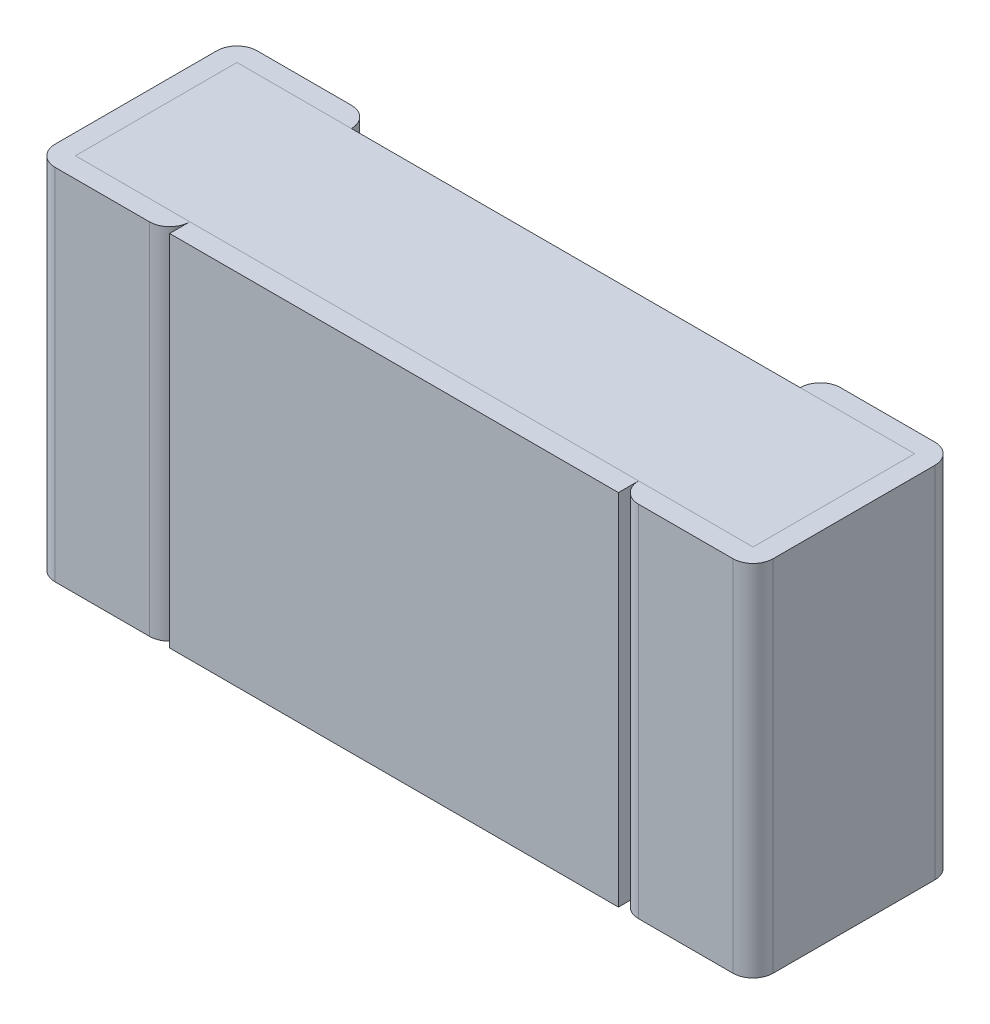
ISO-10303-21;
HEADER;
FILE_DESCRIPTION(('STEP AP214'),'2;1');
FILE_NAME('part.step','',(''),(''),'','','');
FILE_SCHEMA(('AUTOMOTIVE_DESIGN { 1 0 10303 214 1 1 1 1 }'));
ENDSEC;
DATA;
#1=APPLICATION_CONTEXT('core data for automotive mechanical design processes');
#2=APPLICATION_PROTOCOL_DEFINITION('international standard','automotive_design',2000,#1);
#3=PRODUCT_CONTEXT('',#1,'mechanical');
#4=PRODUCT('Part','Part','',(#3));
#5=PRODUCT_RELATED_PRODUCT_CATEGORY('part','',(#4));
#6=PRODUCT_DEFINITION_FORMATION('','',#4);
#7=PRODUCT_DEFINITION_CONTEXT('part definition',#1,'design');
#8=PRODUCT_DEFINITION('design','',#6,#7);
#9=PRODUCT_DEFINITION_SHAPE('','',#8);
#10=(LENGTH_UNIT() NAMED_UNIT(*) SI_UNIT(.MILLI.,.METRE.));
#11=(NAMED_UNIT(*) PLANE_ANGLE_UNIT() SI_UNIT($,.RADIAN.));
#12=(NAMED_UNIT(*) SI_UNIT($,.STERADIAN.) SOLID_ANGLE_UNIT());
#13=UNCERTAINTY_MEASURE_WITH_UNIT(LENGTH_MEASURE(1.E-05),#10,'distance_accuracy_value','');
#14=(GEOMETRIC_REPRESENTATION_CONTEXT(3) GLOBAL_UNCERTAINTY_ASSIGNED_CONTEXT((#13)) GLOBAL_UNIT_ASSIGNED_CONTEXT((#10,
#11,#12)) REPRESENTATION_CONTEXT('',''));
#15=CARTESIAN_POINT('',(0.,0.,0.));
#16=DIRECTION('',(0.,0.,1.));
#17=DIRECTION('',(1.,0.,0.));
#18=AXIS2_PLACEMENT_3D('',#15,#16,#17);
#19=CARTESIAN_POINT('',(-0.5,-0.4,0.45));
#20=DIRECTION('',(0.,0.,1.));
#21=DIRECTION('',(1.,0.,0.));
#22=AXIS2_PLACEMENT_3D('',#19,#20,#21);
#23=PLANE('',#22);
#24=DIRECTION('',(0.,1.,0.));
#25=VECTOR('',#24,1.);
#26=CARTESIAN_POINT('',(-0.5,-0.4,0.45));
#27=LINE('',#26,#25);
#28=CARTESIAN_POINT('',(-0.5,-0.4,0.45));
#29=VERTEX_POINT('',#28);
#30=CARTESIAN_POINT('',(-0.5,0.4,0.45));
#31=VERTEX_POINT('',#30);
#32=EDGE_CURVE('E295',#29,#31,#27,.T.);
#33=ORIENTED_EDGE('',*,*,#32,.F.);
#34=DIRECTION('',(1.,0.,0.));
#35=VECTOR('',#34,1.);
#36=CARTESIAN_POINT('',(-0.5,-0.4,0.45));
#37=LINE('',#36,#35);
#38=CARTESIAN_POINT('',(0.5,-0.4,0.45));
#39=VERTEX_POINT('',#38);
#40=EDGE_CURVE('E238',#29,#39,#37,.T.);
#41=ORIENTED_EDGE('',*,*,#40,.T.);
#42=DIRECTION('',(0.,1.,0.));
#43=VECTOR('',#42,1.);
#44=CARTESIAN_POINT('',(0.5,-0.4,0.45));
#45=LINE('',#44,#43);
#46=CARTESIAN_POINT('',(0.5,0.4,0.45));
#47=VERTEX_POINT('',#46);
#48=EDGE_CURVE('E11',#39,#47,#45,.T.);
#49=ORIENTED_EDGE('',*,*,#48,.T.);
#50=DIRECTION('',(1.,0.,0.));
#51=VECTOR('',#50,1.);
#52=CARTESIAN_POINT('',(-0.5,0.4,0.45));
#53=LINE('',#52,#51);
#54=EDGE_CURVE('E203',#31,#47,#53,.T.);
#55=ORIENTED_EDGE('',*,*,#54,.F.);
#56=EDGE_LOOP('',(#33,#41,#49,#55));
#57=FACE_BOUND('',#56,.T.);
#58=ADVANCED_FACE('F17',(#57),#23,.T.);
#59=CARTESIAN_POINT('',(0.5,-0.4,0.405));
#60=DIRECTION('',(1.,0.,0.));
#61=DIRECTION('',(0.,1.,0.));
#62=AXIS2_PLACEMENT_3D('',#59,#60,#61);
#63=PLANE('',#62);
#64=DIRECTION('',(0.,0.,1.));
#65=VECTOR('',#64,1.);
#66=CARTESIAN_POINT('',(0.5,-0.4,0.405));
#67=LINE('',#66,#65);
#68=CARTESIAN_POINT('',(0.5,-0.4,0.405));
#69=VERTEX_POINT('',#68);
#70=EDGE_CURVE('E227',#69,#39,#67,.T.);
#71=ORIENTED_EDGE('',*,*,#70,.F.);
#72=DIRECTION('',(0.,1.,0.));
#73=VECTOR('',#72,1.);
#74=CARTESIAN_POINT('',(0.5,-0.4,0.405));
#75=LINE('',#74,#73);
#76=CARTESIAN_POINT('',(0.5,0.4,0.405));
#77=VERTEX_POINT('',#76);
#78=EDGE_CURVE('E28',#69,#77,#75,.T.);
#79=ORIENTED_EDGE('',*,*,#78,.T.);
#80=DIRECTION('',(0.,0.,1.));
#81=VECTOR('',#80,1.);
#82=CARTESIAN_POINT('',(0.5,0.4,0.405));
#83=LINE('',#82,#81);
#84=EDGE_CURVE('E265',#77,#47,#83,.T.);
#85=ORIENTED_EDGE('',*,*,#84,.T.);
#86=ORIENTED_EDGE('',*,*,#48,.F.);
#87=EDGE_LOOP('',(#71,#79,#85,#86));
#88=FACE_BOUND('',#87,.T.);
#89=ADVANCED_FACE('F549',(#88),#63,.T.);
#90=CARTESIAN_POINT('',(0.545,-0.4,0.405));
#91=DIRECTION('',(0.,1.,0.));
#92=DIRECTION('',(-1.,0.,0.));
#93=AXIS2_PLACEMENT_3D('',#90,#91,#92);
#94=CYLINDRICAL_SURFACE('',#93,0.045);
#95=CARTESIAN_POINT('',(0.545,-0.4,0.405));
#96=DIRECTION('',(0.,1.,0.));
#97=DIRECTION('',(0.,0.,1.));
#98=AXIS2_PLACEMENT_3D('',#95,#96,#97);
#99=CIRCLE('',#98,0.045);
#100=CARTESIAN_POINT('',(0.545,-0.4,0.45));
#101=VERTEX_POINT('',#100);
#102=EDGE_CURVE('E183',#69,#101,#99,.T.);
#103=ORIENTED_EDGE('',*,*,#102,.T.);
#104=DIRECTION('',(0.,1.,0.));
#105=VECTOR('',#104,1.);
#106=CARTESIAN_POINT('',(0.545,-0.4,0.45));
#107=LINE('',#106,#105);
#108=CARTESIAN_POINT('',(0.545,0.4,0.45));
#109=VERTEX_POINT('',#108);
#110=EDGE_CURVE('E174',#101,#109,#107,.T.);
#111=ORIENTED_EDGE('',*,*,#110,.T.);
#112=CARTESIAN_POINT('',(0.545,0.4,0.405));
#113=DIRECTION('',(0.,1.,0.));
#114=DIRECTION('',(0.,0.,1.));
#115=AXIS2_PLACEMENT_3D('',#112,#113,#114);
#116=CIRCLE('',#115,0.045);
#117=EDGE_CURVE('E369',#77,#109,#116,.T.);
#118=ORIENTED_EDGE('',*,*,#117,.F.);
#119=ORIENTED_EDGE('',*,*,#78,.F.);
#120=EDGE_LOOP('',(#103,#111,#118,#119));
#121=FACE_BOUND('',#120,.T.);
#122=ADVANCED_FACE('F512',(#121),#94,.T.);
#123=CARTESIAN_POINT('',(0.5,-0.4,0.45));
#124=DIRECTION('',(0.,0.,1.));
#125=DIRECTION('',(1.,0.,0.));
#126=AXIS2_PLACEMENT_3D('',#123,#124,#125);
#127=PLANE('',#126);
#128=DIRECTION('',(1.,0.,0.));
#129=VECTOR('',#128,1.);
#130=CARTESIAN_POINT('',(0.5,0.4,0.45));
#131=LINE('',#130,#129);
#132=CARTESIAN_POINT('',(0.755,0.4,0.45));
#133=VERTEX_POINT('',#132);
#134=EDGE_CURVE('E366',#109,#133,#131,.T.);
#135=ORIENTED_EDGE('',*,*,#134,.F.);
#136=ORIENTED_EDGE('',*,*,#110,.F.);
#137=DIRECTION('',(1.,0.,0.));
#138=VECTOR('',#137,1.);
#139=CARTESIAN_POINT('',(0.5,-0.4,0.45));
#140=LINE('',#139,#138);
#141=CARTESIAN_POINT('',(0.755,-0.4,0.45));
#142=VERTEX_POINT('',#141);
#143=EDGE_CURVE('E177',#101,#142,#140,.T.);
#144=ORIENTED_EDGE('',*,*,#143,.T.);
#145=DIRECTION('',(0.,1.,0.));
#146=VECTOR('',#145,1.);
#147=CARTESIAN_POINT('',(0.755,-0.4,0.45));
#148=LINE('',#147,#146);
#149=EDGE_CURVE('E163',#142,#133,#148,.T.);
#150=ORIENTED_EDGE('',*,*,#149,.T.);
#151=EDGE_LOOP('',(#135,#136,#144,#150));
#152=FACE_BOUND('',#151,.T.);
#153=ADVANCED_FACE('F178',(#152),#127,.T.);
#154=CARTESIAN_POINT('',(0.755,-0.4,0.405));
#155=DIRECTION('',(0.,1.,0.));
#156=DIRECTION('',(1.,0.,0.));
#157=AXIS2_PLACEMENT_3D('',#154,#155,#156);
#158=CYLINDRICAL_SURFACE('',#157,0.045);
#159=DIRECTION('',(0.,1.,0.));
#160=VECTOR('',#159,1.);
#161=CARTESIAN_POINT('',(0.8,-0.4,0.405));
#162=LINE('',#161,#160);
#163=CARTESIAN_POINT('',(0.8,-0.4,0.405));
#164=VERTEX_POINT('',#163);
#165=CARTESIAN_POINT('',(0.8,0.4,0.405));
#166=VERTEX_POINT('',#165);
#167=EDGE_CURVE('E156',#164,#166,#162,.T.);
#168=ORIENTED_EDGE('',*,*,#167,.T.);
#169=CARTESIAN_POINT('',(0.755,0.4,0.405));
#170=DIRECTION('',(0.,-1.,0.));
#171=DIRECTION('',(0.,0.,1.));
#172=AXIS2_PLACEMENT_3D('',#169,#170,#171);
#173=CIRCLE('',#172,0.045);
#174=EDGE_CURVE('E21',#166,#133,#173,.T.);
#175=ORIENTED_EDGE('',*,*,#174,.T.);
#176=ORIENTED_EDGE('',*,*,#149,.F.);
#177=CARTESIAN_POINT('',(0.755,-0.4,0.405));
#178=DIRECTION('',(0.,-1.,0.));
#179=DIRECTION('',(0.,0.,1.));
#180=AXIS2_PLACEMENT_3D('',#177,#178,#179);
#181=CIRCLE('',#180,0.045);
#182=EDGE_CURVE('E167',#164,#142,#181,.T.);
#183=ORIENTED_EDGE('',*,*,#182,.F.);
#184=EDGE_LOOP('',(#168,#175,#176,#183));
#185=FACE_BOUND('',#184,.T.);
#186=ADVANCED_FACE('F165',(#185),#158,.T.);
#187=CARTESIAN_POINT('',(0.8,-0.4,0.));
#188=DIRECTION('',(1.,0.,0.));
#189=DIRECTION('',(0.,1.,0.));
#190=AXIS2_PLACEMENT_3D('',#187,#188,#189);
#191=PLANE('',#190);
#192=DIRECTION('',(0.,0.,1.));
#193=VECTOR('',#192,1.);
#194=CARTESIAN_POINT('',(0.8,-0.4,0.));
#195=LINE('',#194,#193);
#196=CARTESIAN_POINT('',(0.8,-0.4,0.045));
#197=VERTEX_POINT('',#196);
#198=EDGE_CURVE('E187',#197,#164,#195,.T.);
#199=ORIENTED_EDGE('',*,*,#198,.F.);
#200=DIRECTION('',(0.,1.,0.));
#201=VECTOR('',#200,1.);
#202=CARTESIAN_POINT('',(0.8,-0.4,0.045));
#203=LINE('',#202,#201);
#204=CARTESIAN_POINT('',(0.8,0.4,0.045));
#205=VERTEX_POINT('',#204);
#206=EDGE_CURVE('E296',#197,#205,#203,.T.);
#207=ORIENTED_EDGE('',*,*,#206,.T.);
#208=DIRECTION('',(0.,0.,1.));
#209=VECTOR('',#208,1.);
#210=CARTESIAN_POINT('',(0.8,0.4,0.));
#211=LINE('',#210,#209);
#212=EDGE_CURVE('E204',#205,#166,#211,.T.);
#213=ORIENTED_EDGE('',*,*,#212,.T.);
#214=ORIENTED_EDGE('',*,*,#167,.F.);
#215=EDGE_LOOP('',(#199,#207,#213,#214));
#216=FACE_BOUND('',#215,.T.);
#217=ADVANCED_FACE('F563',(#216),#191,.T.);
#218=CARTESIAN_POINT('',(0.755,-0.4,0.045));
#219=DIRECTION('',(0.,1.,0.));
#220=DIRECTION('',(1.,0.,0.));
#221=AXIS2_PLACEMENT_3D('',#218,#219,#220);
#222=CYLINDRICAL_SURFACE('',#221,0.045);
#223=CARTESIAN_POINT('',(0.755,-0.4,0.045));
#224=DIRECTION('',(0.,1.,0.));
#225=DIRECTION('',(0.,0.,1.));
#226=AXIS2_PLACEMENT_3D('',#223,#224,#225);
#227=CIRCLE('',#226,0.045);
#228=CARTESIAN_POINT('',(0.755,-0.4,0.));
#229=VERTEX_POINT('',#228);
#230=EDGE_CURVE('E194',#197,#229,#227,.T.);
#231=ORIENTED_EDGE('',*,*,#230,.T.);
#232=DIRECTION('',(0.,1.,0.));
#233=VECTOR('',#232,1.);
#234=CARTESIAN_POINT('',(0.755,-0.4,0.));
#235=LINE('',#234,#233);
#236=CARTESIAN_POINT('',(0.755,0.4,0.));
#237=VERTEX_POINT('',#236);
#238=EDGE_CURVE('E286',#229,#237,#235,.T.);
#239=ORIENTED_EDGE('',*,*,#238,.T.);
#240=CARTESIAN_POINT('',(0.755,0.4,0.045));
#241=DIRECTION('',(0.,1.,0.));
#242=DIRECTION('',(0.,0.,1.));
#243=AXIS2_PLACEMENT_3D('',#240,#241,#242);
#244=CIRCLE('',#243,0.045);
#245=EDGE_CURVE('E200',#205,#237,#244,.T.);
#246=ORIENTED_EDGE('',*,*,#245,.F.);
#247=ORIENTED_EDGE('',*,*,#206,.F.);
#248=EDGE_LOOP('',(#231,#239,#246,#247));
#249=FACE_BOUND('',#248,.T.);
#250=ADVANCED_FACE('F468',(#249),#222,.T.);
#251=CARTESIAN_POINT('',(0.5,-0.4,0.));
#252=DIRECTION('',(0.,0.,1.));
#253=DIRECTION('',(1.,0.,0.));
#254=AXIS2_PLACEMENT_3D('',#251,#252,#253);
#255=PLANE('',#254);
#256=ORIENTED_EDGE('',*,*,#238,.F.);
#257=DIRECTION('',(1.,0.,0.));
#258=VECTOR('',#257,1.);
#259=CARTESIAN_POINT('',(0.5,-0.4,0.));
#260=LINE('',#259,#258);
#261=CARTESIAN_POINT('',(0.545,-0.4,0.));
#262=VERTEX_POINT('',#261);
#263=EDGE_CURVE('E223',#262,#229,#260,.T.);
#264=ORIENTED_EDGE('',*,*,#263,.F.);
#265=DIRECTION('',(0.,1.,0.));
#266=VECTOR('',#265,1.);
#267=CARTESIAN_POINT('',(0.545,-0.4,0.));
#268=LINE('',#267,#266);
#269=CARTESIAN_POINT('',(0.545,0.4,0.));
#270=VERTEX_POINT('',#269);
#271=EDGE_CURVE('E268',#262,#270,#268,.T.);
#272=ORIENTED_EDGE('',*,*,#271,.T.);
#273=DIRECTION('',(1.,0.,0.));
#274=VECTOR('',#273,1.);
#275=CARTESIAN_POINT('',(0.5,0.4,0.));
#276=LINE('',#275,#274);
#277=EDGE_CURVE('E365',#270,#237,#276,.T.);
#278=ORIENTED_EDGE('',*,*,#277,.T.);
#279=EDGE_LOOP('',(#256,#264,#272,#278));
#280=FACE_BOUND('',#279,.T.);
#281=ADVANCED_FACE('F475',(#280),#255,.F.);
#282=CARTESIAN_POINT('',(0.545,-0.4,0.045));
#283=DIRECTION('',(0.,1.,0.));
#284=DIRECTION('',(-1.,0.,0.));
#285=AXIS2_PLACEMENT_3D('',#282,#283,#284);
#286=CYLINDRICAL_SURFACE('',#285,0.045);
#287=DIRECTION('',(0.,1.,0.));
#288=VECTOR('',#287,1.);
#289=CARTESIAN_POINT('',(0.5,-0.4,0.045));
#290=LINE('',#289,#288);
#291=CARTESIAN_POINT('',(0.5,-0.4,0.045));
#292=VERTEX_POINT('',#291);
#293=CARTESIAN_POINT('',(0.5,0.4,0.045));
#294=VERTEX_POINT('',#293);
#295=EDGE_CURVE('E291',#292,#294,#290,.T.);
#296=ORIENTED_EDGE('',*,*,#295,.T.);
#297=CARTESIAN_POINT('',(0.545,0.4,0.045));
#298=DIRECTION('',(0.,-1.,0.));
#299=DIRECTION('',(0.,0.,1.));
#300=AXIS2_PLACEMENT_3D('',#297,#298,#299);
#301=CIRCLE('',#300,0.045);
#302=EDGE_CURVE('E382',#294,#270,#301,.T.);
#303=ORIENTED_EDGE('',*,*,#302,.T.);
#304=ORIENTED_EDGE('',*,*,#271,.F.);
#305=CARTESIAN_POINT('',(0.545,-0.4,0.045));
#306=DIRECTION('',(0.,-1.,0.));
#307=DIRECTION('',(0.,0.,1.));
#308=AXIS2_PLACEMENT_3D('',#305,#306,#307);
#309=CIRCLE('',#308,0.045);
#310=EDGE_CURVE('E228',#292,#262,#309,.T.);
#311=ORIENTED_EDGE('',*,*,#310,.F.);
#312=EDGE_LOOP('',(#296,#303,#304,#311));
#313=FACE_BOUND('',#312,.T.);
#314=ADVANCED_FACE('F479',(#313),#286,.T.);
#315=CARTESIAN_POINT('',(-0.5,0.4,0.405));
#316=DIRECTION('',(0.,1.,0.));
#317=DIRECTION('',(1.,0.,0.));
#318=AXIS2_PLACEMENT_3D('',#315,#316,#317);
#319=PLANE('',#318);
#320=DIRECTION('',(1.,0.,0.));
#321=VECTOR('',#320,1.);
#322=CARTESIAN_POINT('',(-0.5,0.4,0.405));
#323=LINE('',#322,#321);
#324=CARTESIAN_POINT('',(-0.5,0.4,0.405));
#325=VERTEX_POINT('',#324);
#326=EDGE_CURVE('E216',#325,#77,#323,.T.);
#327=ORIENTED_EDGE('',*,*,#326,.F.);
#328=DIRECTION('',(0.,0.,1.));
#329=VECTOR('',#328,1.);
#330=CARTESIAN_POINT('',(-0.5,0.4,0.405));
#331=LINE('',#330,#329);
#332=EDGE_CURVE('E361',#325,#31,#331,.T.);
#333=ORIENTED_EDGE('',*,*,#332,.T.);
#334=ORIENTED_EDGE('',*,*,#54,.T.);
#335=ORIENTED_EDGE('',*,*,#84,.F.);
#336=EDGE_LOOP('',(#327,#333,#334,#335));
#337=FACE_BOUND('',#336,.T.);
#338=ADVANCED_FACE('F543',(#337),#319,.T.);
#339=CARTESIAN_POINT('',(0.5,0.4,0.));
#340=DIRECTION('',(0.,1.,0.));
#341=DIRECTION('',(1.,0.,0.));
#342=AXIS2_PLACEMENT_3D('',#339,#340,#341);
#343=PLANE('',#342);
#344=ORIENTED_EDGE('',*,*,#277,.F.);
#345=ORIENTED_EDGE('',*,*,#302,.F.);
#346=DIRECTION('',(1.,0.,0.));
#347=VECTOR('',#346,1.);
#348=CARTESIAN_POINT('',(-0.755,0.4,0.045));
#349=LINE('',#348,#347);
#350=CARTESIAN_POINT('',(0.755,0.4,0.045));
#351=VERTEX_POINT('',#350);
#352=EDGE_CURVE('E253',#294,#351,#349,.T.);
#353=ORIENTED_EDGE('',*,*,#352,.T.);
#354=DIRECTION('',(0.,0.,1.));
#355=VECTOR('',#354,1.);
#356=CARTESIAN_POINT('',(0.755,0.4,0.045));
#357=LINE('',#356,#355);
#358=CARTESIAN_POINT('',(0.755,0.4,0.405));
#359=VERTEX_POINT('',#358);
#360=EDGE_CURVE('E215',#351,#359,#357,.T.);
#361=ORIENTED_EDGE('',*,*,#360,.T.);
#362=DIRECTION('',(1.,0.,0.));
#363=VECTOR('',#362,1.);
#364=CARTESIAN_POINT('',(-0.755,0.4,0.405));
#365=LINE('',#364,#363);
#366=EDGE_CURVE('E211',#77,#359,#365,.T.);
#367=ORIENTED_EDGE('',*,*,#366,.F.);
#368=ORIENTED_EDGE('',*,*,#117,.T.);
#369=ORIENTED_EDGE('',*,*,#134,.T.);
#370=ORIENTED_EDGE('',*,*,#174,.F.);
#371=ORIENTED_EDGE('',*,*,#212,.F.);
#372=ORIENTED_EDGE('',*,*,#245,.T.);
#373=EDGE_LOOP('',(#344,#345,#353,#361,#367,#368,#369,#370,#371,#372));
#374=FACE_BOUND('',#373,.T.);
#375=ADVANCED_FACE('F474',(#374),#343,.T.);
#376=CARTESIAN_POINT('',(-0.5,-0.4,0.405));
#377=DIRECTION('',(1.,0.,0.));
#378=DIRECTION('',(0.,1.,0.));
#379=AXIS2_PLACEMENT_3D('',#376,#377,#378);
#380=PLANE('',#379);
#381=ORIENTED_EDGE('',*,*,#32,.T.);
#382=ORIENTED_EDGE('',*,*,#332,.F.);
#383=DIRECTION('',(0.,1.,0.));
#384=VECTOR('',#383,1.);
#385=CARTESIAN_POINT('',(-0.5,-0.4,0.405));
#386=LINE('',#385,#384);
#387=CARTESIAN_POINT('',(-0.5,-0.4,0.405));
#388=VERTEX_POINT('',#387);
#389=EDGE_CURVE('E254',#388,#325,#386,.T.);
#390=ORIENTED_EDGE('',*,*,#389,.F.);
#391=DIRECTION('',(0.,0.,1.));
#392=VECTOR('',#391,1.);
#393=CARTESIAN_POINT('',(-0.5,-0.4,0.405));
#394=LINE('',#393,#392);
#395=EDGE_CURVE('E264',#388,#29,#394,.T.);
#396=ORIENTED_EDGE('',*,*,#395,.T.);
#397=EDGE_LOOP('',(#381,#382,#390,#396));
#398=FACE_BOUND('',#397,.T.);
#399=ADVANCED_FACE('F547',(#398),#380,.F.);
#400=CARTESIAN_POINT('',(-0.5,-0.4,0.405));
#401=DIRECTION('',(0.,1.,0.));
#402=DIRECTION('',(1.,0.,0.));
#403=AXIS2_PLACEMENT_3D('',#400,#401,#402);
#404=PLANE('',#403);
#405=ORIENTED_EDGE('',*,*,#70,.T.);
#406=ORIENTED_EDGE('',*,*,#40,.F.);
#407=ORIENTED_EDGE('',*,*,#395,.F.);
#408=DIRECTION('',(1.,0.,0.));
#409=VECTOR('',#408,1.);
#410=CARTESIAN_POINT('',(-0.5,-0.4,0.405));
#411=LINE('',#410,#409);
#412=EDGE_CURVE('E198',#388,#69,#411,.T.);
#413=ORIENTED_EDGE('',*,*,#412,.T.);
#414=EDGE_LOOP('',(#405,#406,#407,#413));
#415=FACE_BOUND('',#414,.T.);
#416=ADVANCED_FACE('F518',(#415),#404,.F.);
#417=CARTESIAN_POINT('',(0.5,-0.4,0.));
#418=DIRECTION('',(0.,1.,0.));
#419=DIRECTION('',(1.,0.,0.));
#420=AXIS2_PLACEMENT_3D('',#417,#418,#419);
#421=PLANE('',#420);
#422=ORIENTED_EDGE('',*,*,#230,.F.);
#423=ORIENTED_EDGE('',*,*,#198,.T.);
#424=ORIENTED_EDGE('',*,*,#182,.T.);
#425=ORIENTED_EDGE('',*,*,#143,.F.);
#426=ORIENTED_EDGE('',*,*,#102,.F.);
#427=DIRECTION('',(1.,0.,0.));
#428=VECTOR('',#427,1.);
#429=CARTESIAN_POINT('',(-0.755,-0.4,0.405));
#430=LINE('',#429,#428);
#431=CARTESIAN_POINT('',(0.755,-0.4,0.405));
#432=VERTEX_POINT('',#431);
#433=EDGE_CURVE('E239',#69,#432,#430,.T.);
#434=ORIENTED_EDGE('',*,*,#433,.T.);
#435=DIRECTION('',(0.,0.,1.));
#436=VECTOR('',#435,1.);
#437=CARTESIAN_POINT('',(0.755,-0.4,0.045));
#438=LINE('',#437,#436);
#439=CARTESIAN_POINT('',(0.755,-0.4,0.045));
#440=VERTEX_POINT('',#439);
#441=EDGE_CURVE('E242',#440,#432,#438,.T.);
#442=ORIENTED_EDGE('',*,*,#441,.F.);
#443=DIRECTION('',(1.,0.,0.));
#444=VECTOR('',#443,1.);
#445=CARTESIAN_POINT('',(-0.755,-0.4,0.045));
#446=LINE('',#445,#444);
#447=EDGE_CURVE('E248',#292,#440,#446,.T.);
#448=ORIENTED_EDGE('',*,*,#447,.F.);
#449=ORIENTED_EDGE('',*,*,#310,.T.);
#450=ORIENTED_EDGE('',*,*,#263,.T.);
#451=EDGE_LOOP('',(#422,#423,#424,#425,#426,#434,#442,#448,#449,#450));
#452=FACE_BOUND('',#451,.T.);
#453=ADVANCED_FACE('F186',(#452),#421,.F.);
#454=CARTESIAN_POINT('',(-0.755,-0.4,0.045));
#455=DIRECTION('',(0.,0.,1.));
#456=DIRECTION('',(1.,0.,0.));
#457=AXIS2_PLACEMENT_3D('',#454,#455,#456);
#458=PLANE('',#457);
#459=DIRECTION('',(1.,0.,0.));
#460=VECTOR('',#459,1.);
#461=CARTESIAN_POINT('',(-0.755,0.4,0.045));
#462=LINE('',#461,#460);
#463=CARTESIAN_POINT('',(-0.5,0.4,0.045));
#464=VERTEX_POINT('',#463);
#465=EDGE_CURVE('E349',#464,#294,#462,.T.);
#466=ORIENTED_EDGE('',*,*,#465,.T.);
#467=ORIENTED_EDGE('',*,*,#295,.F.);
#468=DIRECTION('',(1.,0.,0.));
#469=VECTOR('',#468,1.);
#470=CARTESIAN_POINT('',(-0.755,-0.4,0.045));
#471=LINE('',#470,#469);
#472=CARTESIAN_POINT('',(-0.5,-0.4,0.045));
#473=VERTEX_POINT('',#472);
#474=EDGE_CURVE('E244',#473,#292,#471,.T.);
#475=ORIENTED_EDGE('',*,*,#474,.F.);
#476=DIRECTION('',(0.,1.,0.));
#477=VECTOR('',#476,1.);
#478=CARTESIAN_POINT('',(-0.5,-0.4,0.045));
#479=LINE('',#478,#477);
#480=EDGE_CURVE('E249',#473,#464,#479,.T.);
#481=ORIENTED_EDGE('',*,*,#480,.T.);
#482=EDGE_LOOP('',(#466,#467,#475,#481));
#483=FACE_BOUND('',#482,.T.);
#484=ADVANCED_FACE('F526',(#483),#458,.F.);
#485=CARTESIAN_POINT('',(-0.755,0.4,0.045));
#486=DIRECTION('',(0.,1.,0.));
#487=DIRECTION('',(1.,0.,0.));
#488=AXIS2_PLACEMENT_3D('',#485,#486,#487);
#489=PLANE('',#488);
#490=DIRECTION('',(1.,0.,0.));
#491=VECTOR('',#490,1.);
#492=CARTESIAN_POINT('',(-0.755,0.4,0.045));
#493=LINE('',#492,#491);
#494=CARTESIAN_POINT('',(-0.755,0.4,0.045));
#495=VERTEX_POINT('',#494);
#496=EDGE_CURVE('E217',#495,#464,#493,.T.);
#497=ORIENTED_EDGE('',*,*,#496,.F.);
#498=DIRECTION('',(0.,0.,1.));
#499=VECTOR('',#498,1.);
#500=CARTESIAN_POINT('',(-0.755,0.4,0.045));
#501=LINE('',#500,#499);
#502=CARTESIAN_POINT('',(-0.755,0.4,0.405));
#503=VERTEX_POINT('',#502);
#504=EDGE_CURVE('E222',#495,#503,#501,.T.);
#505=ORIENTED_EDGE('',*,*,#504,.T.);
#506=DIRECTION('',(1.,0.,0.));
#507=VECTOR('',#506,1.);
#508=CARTESIAN_POINT('',(-0.755,0.4,0.405));
#509=LINE('',#508,#507);
#510=EDGE_CURVE('E356',#503,#325,#509,.T.);
#511=ORIENTED_EDGE('',*,*,#510,.T.);
#512=ORIENTED_EDGE('',*,*,#326,.T.);
#513=ORIENTED_EDGE('',*,*,#366,.T.);
#514=ORIENTED_EDGE('',*,*,#360,.F.);
#515=ORIENTED_EDGE('',*,*,#352,.F.);
#516=ORIENTED_EDGE('',*,*,#465,.F.);
#517=EDGE_LOOP('',(#497,#505,#511,#512,#513,#514,#515,#516));
#518=FACE_BOUND('',#517,.T.);
#519=ADVANCED_FACE('F19',(#518),#489,.T.);
#520=CARTESIAN_POINT('',(-0.545,-0.4,0.405));
#521=DIRECTION('',(0.,1.,0.));
#522=DIRECTION('',(1.,0.,0.));
#523=AXIS2_PLACEMENT_3D('',#520,#521,#522);
#524=CYLINDRICAL_SURFACE('',#523,0.045);
#525=ORIENTED_EDGE('',*,*,#389,.T.);
#526=CARTESIAN_POINT('',(-0.545,0.4,0.405));
#527=DIRECTION('',(0.,-1.,0.));
#528=DIRECTION('',(0.,0.,1.));
#529=AXIS2_PLACEMENT_3D('',#526,#527,#528);
#530=CIRCLE('',#529,0.045);
#531=CARTESIAN_POINT('',(-0.545,0.4,0.45));
#532=VERTEX_POINT('',#531);
#533=EDGE_CURVE('E360',#325,#532,#530,.T.);
#534=ORIENTED_EDGE('',*,*,#533,.T.);
#535=DIRECTION('',(0.,1.,0.));
#536=VECTOR('',#535,1.);
#537=CARTESIAN_POINT('',(-0.545,-0.4,0.45));
#538=LINE('',#537,#536);
#539=CARTESIAN_POINT('',(-0.545,-0.4,0.45));
#540=VERTEX_POINT('',#539);
#541=EDGE_CURVE('E258',#540,#532,#538,.T.);
#542=ORIENTED_EDGE('',*,*,#541,.F.);
#543=CARTESIAN_POINT('',(-0.545,-0.4,0.405));
#544=DIRECTION('',(0.,-1.,0.));
#545=DIRECTION('',(0.,0.,1.));
#546=AXIS2_PLACEMENT_3D('',#543,#544,#545);
#547=CIRCLE('',#546,0.045);
#548=EDGE_CURVE('E343',#388,#540,#547,.T.);
#549=ORIENTED_EDGE('',*,*,#548,.F.);
#550=EDGE_LOOP('',(#525,#534,#542,#549));
#551=FACE_BOUND('',#550,.T.);
#552=ADVANCED_FACE('F545',(#551),#524,.T.);
#553=CARTESIAN_POINT('',(-0.8,-0.4,0.45));
#554=DIRECTION('',(0.,0.,1.));
#555=DIRECTION('',(1.,0.,0.));
#556=AXIS2_PLACEMENT_3D('',#553,#554,#555);
#557=PLANE('',#556);
#558=DIRECTION('',(1.,0.,0.));
#559=VECTOR('',#558,1.);
#560=CARTESIAN_POINT('',(-0.8,0.4,0.45));
#561=LINE('',#560,#559);
#562=CARTESIAN_POINT('',(-0.755,0.4,0.45));
#563=VERTEX_POINT('',#562);
#564=EDGE_CURVE('E273',#563,#532,#561,.T.);
#565=ORIENTED_EDGE('',*,*,#564,.F.);
#566=DIRECTION('',(0.,1.,0.));
#567=VECTOR('',#566,1.);
#568=CARTESIAN_POINT('',(-0.755,-0.4,0.45));
#569=LINE('',#568,#567);
#570=CARTESIAN_POINT('',(-0.755,-0.4,0.45));
#571=VERTEX_POINT('',#570);
#572=EDGE_CURVE('E209',#571,#563,#569,.T.);
#573=ORIENTED_EDGE('',*,*,#572,.F.);
#574=DIRECTION('',(1.,0.,0.));
#575=VECTOR('',#574,1.);
#576=CARTESIAN_POINT('',(-0.8,-0.4,0.45));
#577=LINE('',#576,#575);
#578=EDGE_CURVE('E338',#571,#540,#577,.T.);
#579=ORIENTED_EDGE('',*,*,#578,.T.);
#580=ORIENTED_EDGE('',*,*,#541,.T.);
#581=EDGE_LOOP('',(#565,#573,#579,#580));
#582=FACE_BOUND('',#581,.T.);
#583=ADVANCED_FACE('F575',(#582),#557,.T.);
#584=CARTESIAN_POINT('',(-0.755,-0.4,0.045));
#585=DIRECTION('',(0.,1.,0.));
#586=DIRECTION('',(1.,0.,0.));
#587=AXIS2_PLACEMENT_3D('',#584,#585,#586);
#588=PLANE('',#587);
#589=ORIENTED_EDGE('',*,*,#474,.T.);
#590=ORIENTED_EDGE('',*,*,#447,.T.);
#591=ORIENTED_EDGE('',*,*,#441,.T.);
#592=ORIENTED_EDGE('',*,*,#433,.F.);
#593=ORIENTED_EDGE('',*,*,#412,.F.);
#594=DIRECTION('',(1.,0.,0.));
#595=VECTOR('',#594,1.);
#596=CARTESIAN_POINT('',(-0.755,-0.4,0.405));
#597=LINE('',#596,#595);
#598=CARTESIAN_POINT('',(-0.755,-0.4,0.405));
#599=VERTEX_POINT('',#598);
#600=EDGE_CURVE('E98',#599,#388,#597,.T.);
#601=ORIENTED_EDGE('',*,*,#600,.F.);
#602=DIRECTION('',(0.,0.,1.));
#603=VECTOR('',#602,1.);
#604=CARTESIAN_POINT('',(-0.755,-0.4,0.045));
#605=LINE('',#604,#603);
#606=CARTESIAN_POINT('',(-0.755,-0.4,0.045));
#607=VERTEX_POINT('',#606);
#608=EDGE_CURVE('E111',#607,#599,#605,.T.);
#609=ORIENTED_EDGE('',*,*,#608,.F.);
#610=DIRECTION('',(1.,0.,0.));
#611=VECTOR('',#610,1.);
#612=CARTESIAN_POINT('',(-0.755,-0.4,0.045));
#613=LINE('',#612,#611);
#614=EDGE_CURVE('E331',#607,#473,#613,.T.);
#615=ORIENTED_EDGE('',*,*,#614,.T.);
#616=EDGE_LOOP('',(#589,#590,#591,#592,#593,#601,#609,#615));
#617=FACE_BOUND('',#616,.T.);
#618=ADVANCED_FACE('F522',(#617),#588,.F.);
#619=CARTESIAN_POINT('',(-0.545,-0.4,0.045));
#620=DIRECTION('',(0.,1.,0.));
#621=DIRECTION('',(1.,0.,0.));
#622=AXIS2_PLACEMENT_3D('',#619,#620,#621);
#623=CYLINDRICAL_SURFACE('',#622,0.045);
#624=CARTESIAN_POINT('',(-0.545,-0.4,0.045));
#625=DIRECTION('',(0.,1.,0.));
#626=DIRECTION('',(0.,0.,1.));
#627=AXIS2_PLACEMENT_3D('',#624,#625,#626);
#628=CIRCLE('',#627,0.045);
#629=CARTESIAN_POINT('',(-0.545,-0.4,0.));
#630=VERTEX_POINT('',#629);
#631=EDGE_CURVE('E233',#473,#630,#628,.T.);
#632=ORIENTED_EDGE('',*,*,#631,.T.);
#633=DIRECTION('',(0.,1.,0.));
#634=VECTOR('',#633,1.);
#635=CARTESIAN_POINT('',(-0.545,-0.4,0.));
#636=LINE('',#635,#634);
#637=CARTESIAN_POINT('',(-0.545,0.4,0.));
#638=VERTEX_POINT('',#637);
#639=EDGE_CURVE('E337',#630,#638,#636,.T.);
#640=ORIENTED_EDGE('',*,*,#639,.T.);
#641=CARTESIAN_POINT('',(-0.545,0.4,0.045));
#642=DIRECTION('',(0.,1.,0.));
#643=DIRECTION('',(0.,0.,1.));
#644=AXIS2_PLACEMENT_3D('',#641,#642,#643);
#645=CIRCLE('',#644,0.045);
#646=EDGE_CURVE('E221',#464,#638,#645,.T.);
#647=ORIENTED_EDGE('',*,*,#646,.F.);
#648=ORIENTED_EDGE('',*,*,#480,.F.);
#649=EDGE_LOOP('',(#632,#640,#647,#648));
#650=FACE_BOUND('',#649,.T.);
#651=ADVANCED_FACE('F529',(#650),#623,.T.);
#652=CARTESIAN_POINT('',(-0.8,-0.4,0.));
#653=DIRECTION('',(0.,0.,1.));
#654=DIRECTION('',(1.,0.,0.));
#655=AXIS2_PLACEMENT_3D('',#652,#653,#654);
#656=PLANE('',#655);
#657=ORIENTED_EDGE('',*,*,#639,.F.);
#658=DIRECTION('',(1.,0.,0.));
#659=VECTOR('',#658,1.);
#660=CARTESIAN_POINT('',(-0.8,-0.4,0.));
#661=LINE('',#660,#659);
#662=CARTESIAN_POINT('',(-0.755,-0.4,0.));
#663=VERTEX_POINT('',#662);
#664=EDGE_CURVE('E279',#663,#630,#661,.T.);
#665=ORIENTED_EDGE('',*,*,#664,.F.);
#666=DIRECTION('',(0.,1.,0.));
#667=VECTOR('',#666,1.);
#668=CARTESIAN_POINT('',(-0.755,-0.4,0.));
#669=LINE('',#668,#667);
#670=CARTESIAN_POINT('',(-0.755,0.4,0.));
#671=VERTEX_POINT('',#670);
#672=EDGE_CURVE('E205',#663,#671,#669,.T.);
#673=ORIENTED_EDGE('',*,*,#672,.T.);
#674=DIRECTION('',(1.,0.,0.));
#675=VECTOR('',#674,1.);
#676=CARTESIAN_POINT('',(-0.8,0.4,0.));
#677=LINE('',#676,#675);
#678=EDGE_CURVE('E269',#671,#638,#677,.T.);
#679=ORIENTED_EDGE('',*,*,#678,.T.);
#680=EDGE_LOOP('',(#657,#665,#673,#679));
#681=FACE_BOUND('',#680,.T.);
#682=ADVANCED_FACE('F566',(#681),#656,.F.);
#683=CARTESIAN_POINT('',(-0.8,0.4,0.));
#684=DIRECTION('',(0.,1.,0.));
#685=DIRECTION('',(1.,0.,0.));
#686=AXIS2_PLACEMENT_3D('',#683,#684,#685);
#687=PLANE('',#686);
#688=ORIENTED_EDGE('',*,*,#678,.F.);
#689=CARTESIAN_POINT('',(-0.755,0.4,0.045));
#690=DIRECTION('',(0.,-1.,0.));
#691=DIRECTION('',(0.,0.,1.));
#692=AXIS2_PLACEMENT_3D('',#689,#690,#691);
#693=CIRCLE('',#692,0.045);
#694=CARTESIAN_POINT('',(-0.8,0.4,0.045));
#695=VERTEX_POINT('',#694);
#696=EDGE_CURVE('E210',#695,#671,#693,.T.);
#697=ORIENTED_EDGE('',*,*,#696,.F.);
#698=DIRECTION('',(0.,0.,1.));
#699=VECTOR('',#698,1.);
#700=CARTESIAN_POINT('',(-0.8,0.4,0.));
#701=LINE('',#700,#699);
#702=CARTESIAN_POINT('',(-0.8,0.4,0.405));
#703=VERTEX_POINT('',#702);
#704=EDGE_CURVE('E278',#695,#703,#701,.T.);
#705=ORIENTED_EDGE('',*,*,#704,.T.);
#706=CARTESIAN_POINT('',(-0.755,0.4,0.405));
#707=DIRECTION('',(0.,1.,0.));
#708=DIRECTION('',(0.,0.,1.));
#709=AXIS2_PLACEMENT_3D('',#706,#707,#708);
#710=CIRCLE('',#709,0.045);
#711=EDGE_CURVE('E274',#703,#563,#710,.T.);
#712=ORIENTED_EDGE('',*,*,#711,.T.);
#713=ORIENTED_EDGE('',*,*,#564,.T.);
#714=ORIENTED_EDGE('',*,*,#533,.F.);
#715=ORIENTED_EDGE('',*,*,#510,.F.);
#716=ORIENTED_EDGE('',*,*,#504,.F.);
#717=ORIENTED_EDGE('',*,*,#496,.T.);
#718=ORIENTED_EDGE('',*,*,#646,.T.);
#719=EDGE_LOOP('',(#688,#697,#705,#712,#713,#714,#715,#716,#717,#718));
#720=FACE_BOUND('',#719,.T.);
#721=ADVANCED_FACE('F533',(#720),#687,.T.);
#722=CARTESIAN_POINT('',(-0.755,-0.4,0.405));
#723=DIRECTION('',(0.,1.,0.));
#724=DIRECTION('',(-1.,0.,0.));
#725=AXIS2_PLACEMENT_3D('',#722,#723,#724);
#726=CYLINDRICAL_SURFACE('',#725,0.045);
#727=CARTESIAN_POINT('',(-0.755,-0.4,0.405));
#728=DIRECTION('',(0.,1.,0.));
#729=DIRECTION('',(0.,0.,1.));
#730=AXIS2_PLACEMENT_3D('',#727,#728,#729);
#731=CIRCLE('',#730,0.045);
#732=CARTESIAN_POINT('',(-0.8,-0.4,0.405));
#733=VERTEX_POINT('',#732);
#734=EDGE_CURVE('E342',#733,#571,#731,.T.);
#735=ORIENTED_EDGE('',*,*,#734,.T.);
#736=ORIENTED_EDGE('',*,*,#572,.T.);
#737=ORIENTED_EDGE('',*,*,#711,.F.);
#738=DIRECTION('',(0.,1.,0.));
#739=VECTOR('',#738,1.);
#740=CARTESIAN_POINT('',(-0.8,-0.4,0.405));
#741=LINE('',#740,#739);
#742=EDGE_CURVE('E309',#733,#703,#741,.T.);
#743=ORIENTED_EDGE('',*,*,#742,.F.);
#744=EDGE_LOOP('',(#735,#736,#737,#743));
#745=FACE_BOUND('',#744,.T.);
#746=ADVANCED_FACE('F592',(#745),#726,.T.);
#747=CARTESIAN_POINT('',(-0.755,-0.4,0.045));
#748=DIRECTION('',(0.,1.,0.));
#749=DIRECTION('',(-1.,0.,0.));
#750=AXIS2_PLACEMENT_3D('',#747,#748,#749);
#751=CYLINDRICAL_SURFACE('',#750,0.045);
#752=DIRECTION('',(0.,1.,0.));
#753=VECTOR('',#752,1.);
#754=CARTESIAN_POINT('',(-0.8,-0.4,0.045));
#755=LINE('',#754,#753);
#756=CARTESIAN_POINT('',(-0.8,-0.4,0.045));
#757=VERTEX_POINT('',#756);
#758=EDGE_CURVE('E234',#757,#695,#755,.T.);
#759=ORIENTED_EDGE('',*,*,#758,.T.);
#760=ORIENTED_EDGE('',*,*,#696,.T.);
#761=ORIENTED_EDGE('',*,*,#672,.F.);
#762=CARTESIAN_POINT('',(-0.755,-0.4,0.045));
#763=DIRECTION('',(0.,-1.,0.));
#764=DIRECTION('',(0.,0.,1.));
#765=AXIS2_PLACEMENT_3D('',#762,#763,#764);
#766=CIRCLE('',#765,0.045);
#767=EDGE_CURVE('E283',#757,#663,#766,.T.);
#768=ORIENTED_EDGE('',*,*,#767,.F.);
#769=EDGE_LOOP('',(#759,#760,#761,#768));
#770=FACE_BOUND('',#769,.T.);
#771=ADVANCED_FACE('F405',(#770),#751,.T.);
#772=CARTESIAN_POINT('',(-0.8,-0.4,0.));
#773=DIRECTION('',(0.,1.,0.));
#774=DIRECTION('',(1.,0.,0.));
#775=AXIS2_PLACEMENT_3D('',#772,#773,#774);
#776=PLANE('',#775);
#777=ORIENTED_EDGE('',*,*,#631,.F.);
#778=ORIENTED_EDGE('',*,*,#614,.F.);
#779=ORIENTED_EDGE('',*,*,#608,.T.);
#780=ORIENTED_EDGE('',*,*,#600,.T.);
#781=ORIENTED_EDGE('',*,*,#548,.T.);
#782=ORIENTED_EDGE('',*,*,#578,.F.);
#783=ORIENTED_EDGE('',*,*,#734,.F.);
#784=DIRECTION('',(0.,0.,1.));
#785=VECTOR('',#784,1.);
#786=CARTESIAN_POINT('',(-0.8,-0.4,0.));
#787=LINE('',#786,#785);
#788=EDGE_CURVE('E229',#757,#733,#787,.T.);
#789=ORIENTED_EDGE('',*,*,#788,.F.);
#790=ORIENTED_EDGE('',*,*,#767,.T.);
#791=ORIENTED_EDGE('',*,*,#664,.T.);
#792=EDGE_LOOP('',(#777,#778,#779,#780,#781,#782,#783,#789,#790,#791));
#793=FACE_BOUND('',#792,.T.);
#794=ADVANCED_FACE('F395',(#793),#776,.F.);
#795=CARTESIAN_POINT('',(-0.8,-0.4,0.));
#796=DIRECTION('',(1.,0.,0.));
#797=DIRECTION('',(0.,1.,0.));
#798=AXIS2_PLACEMENT_3D('',#795,#796,#797);
#799=PLANE('',#798);
#800=ORIENTED_EDGE('',*,*,#742,.T.);
#801=ORIENTED_EDGE('',*,*,#704,.F.);
#802=ORIENTED_EDGE('',*,*,#758,.F.);
#803=ORIENTED_EDGE('',*,*,#788,.T.);
#804=EDGE_LOOP('',(#800,#801,#802,#803));
#805=FACE_BOUND('',#804,.T.);
#806=ADVANCED_FACE('F560',(#805),#799,.F.);
#807=CLOSED_SHELL('',(#58,#89,#122,#153,#186,#217,#250,#281,#314,#338,#375,#399,#416,#453,#484,
#519,#552,#583,#618,#651,#682,#721,#746,#771,#794,#806));
#808=MANIFOLD_SOLID_BREP('B1',#807);
#809=ADVANCED_BREP_SHAPE_REPRESENTATION('',(#18,#808),#14);
#810=SHAPE_DEFINITION_REPRESENTATION(#9,#809);
ENDSEC;
END-ISO-10303-21;
